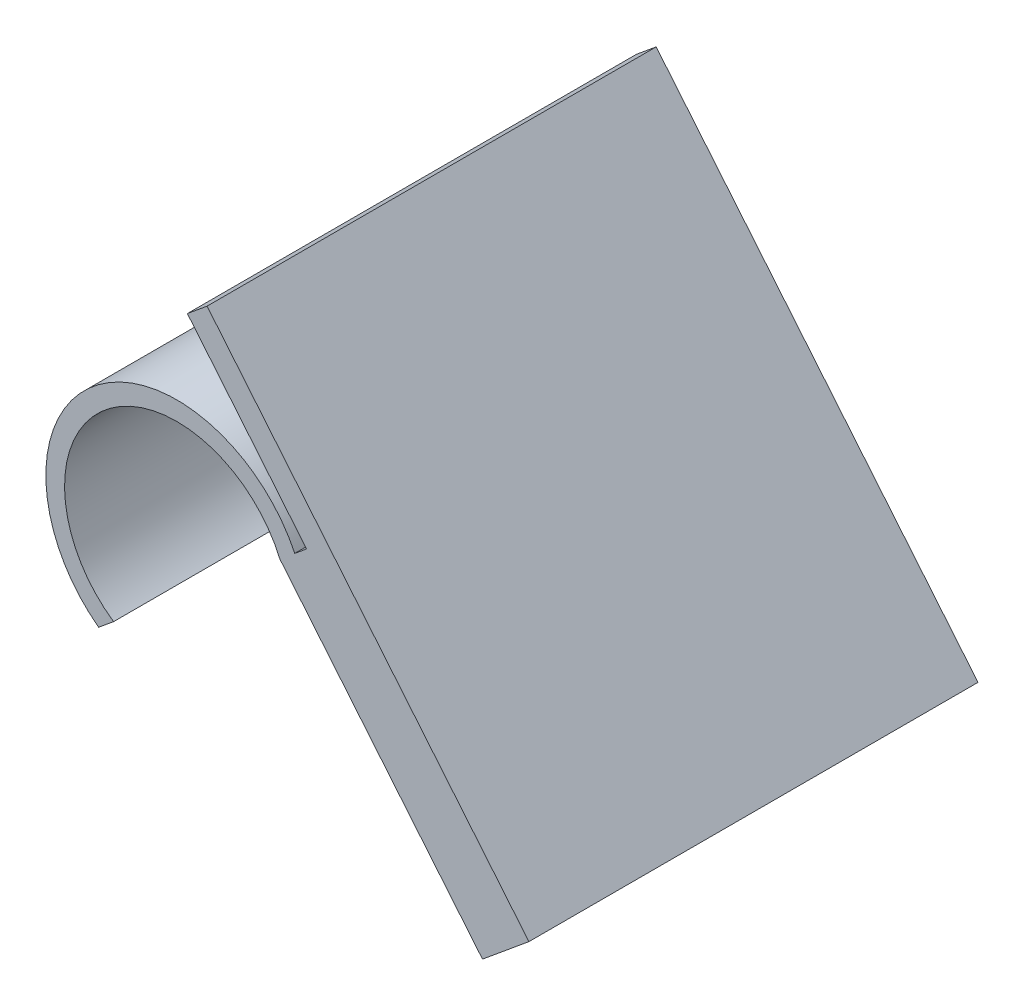
ISO-10303-21;
HEADER;
FILE_DESCRIPTION(('STEP AP214'),'2;1');
FILE_NAME('part.step','',(''),(''),'','','');
FILE_SCHEMA(('AUTOMOTIVE_DESIGN { 1 0 10303 214 1 1 1 1 }'));
ENDSEC;
DATA;
#1=APPLICATION_CONTEXT('core data for automotive mechanical design processes');
#2=APPLICATION_PROTOCOL_DEFINITION('international standard','automotive_design',2000,#1);
#3=PRODUCT_CONTEXT('',#1,'mechanical');
#4=PRODUCT('Part','Part','',(#3));
#5=PRODUCT_RELATED_PRODUCT_CATEGORY('part','',(#4));
#6=PRODUCT_DEFINITION_FORMATION('','',#4);
#7=PRODUCT_DEFINITION_CONTEXT('part definition',#1,'design');
#8=PRODUCT_DEFINITION('design','',#6,#7);
#9=PRODUCT_DEFINITION_SHAPE('','',#8);
#10=(LENGTH_UNIT() NAMED_UNIT(*) SI_UNIT(.MILLI.,.METRE.));
#11=(NAMED_UNIT(*) PLANE_ANGLE_UNIT() SI_UNIT($,.RADIAN.));
#12=(NAMED_UNIT(*) SI_UNIT($,.STERADIAN.) SOLID_ANGLE_UNIT());
#13=UNCERTAINTY_MEASURE_WITH_UNIT(LENGTH_MEASURE(1.E-05),#10,'distance_accuracy_value','');
#14=(GEOMETRIC_REPRESENTATION_CONTEXT(3) GLOBAL_UNCERTAINTY_ASSIGNED_CONTEXT((#13)) GLOBAL_UNIT_ASSIGNED_CONTEXT((#10,
#11,#12)) REPRESENTATION_CONTEXT('',''));
#15=CARTESIAN_POINT('',(0.,0.,0.));
#16=DIRECTION('',(0.,0.,1.));
#17=DIRECTION('',(1.,0.,0.));
#18=AXIS2_PLACEMENT_3D('',#15,#16,#17);
#19=CARTESIAN_POINT('',(6.74647177905313,-8.16423119668458,0.));
#20=DIRECTION('',(0.636999680329431,-0.770864065357961,0.));
#21=DIRECTION('',(0.770864065357961,0.636999680329431,0.));
#22=AXIS2_PLACEMENT_3D('',#19,#20,#21);
#23=PLANE('',#22);
#24=DIRECTION('',(0.,0.,1.));
#25=VECTOR('',#24,1.);
#26=CARTESIAN_POINT('',(44.0234550776681,22.6394182558772,0.));
#27=LINE('',#26,#25);
#28=CARTESIAN_POINT('',(44.0234550776681,22.6394182558772,0.));
#29=VERTEX_POINT('',#28);
#30=CARTESIAN_POINT('',(44.0234550776681,22.6394182558772,152.4));
#31=VERTEX_POINT('',#30);
#32=EDGE_CURVE('E132',#29,#31,#27,.T.);
#33=ORIENTED_EDGE('',*,*,#32,.F.);
#34=DIRECTION('',(0.770864065357961,0.636999680329431,0.));
#35=VECTOR('',#34,1.);
#36=CARTESIAN_POINT('',(34.9588375440872,15.1489167126274,0.));
#37=LINE('',#36,#35);
#38=CARTESIAN_POINT('',(40.0245310525491,19.3349273084627,0.));
#39=VERTEX_POINT('',#38);
#40=EDGE_CURVE('E149',#39,#29,#37,.T.);
#41=ORIENTED_EDGE('',*,*,#40,.F.);
#42=DIRECTION('',(0.,0.,1.));
#43=VECTOR('',#42,1.);
#44=CARTESIAN_POINT('',(40.0245310525491,19.3349273084627,0.));
#45=LINE('',#44,#43);
#46=CARTESIAN_POINT('',(40.0245310525491,19.3349273084627,152.4));
#47=VERTEX_POINT('',#46);
#48=EDGE_CURVE('E160',#39,#47,#45,.T.);
#49=ORIENTED_EDGE('',*,*,#48,.T.);
#50=DIRECTION('',(-0.770864065357961,-0.636999680329431,0.));
#51=VECTOR('',#50,1.);
#52=CARTESIAN_POINT('',(34.9588375440872,15.1489167126274,152.4));
#53=LINE('',#52,#51);
#54=EDGE_CURVE('E152',#31,#47,#53,.T.);
#55=ORIENTED_EDGE('',*,*,#54,.F.);
#56=EDGE_LOOP('',(#33,#41,#49,#55));
#57=FACE_BOUND('',#56,.T.);
#58=ADVANCED_FACE('F33',(#57),#23,.F.);
#59=CARTESIAN_POINT('',(0.,0.,152.4));
#60=DIRECTION('',(0.,0.,1.));
#61=DIRECTION('',(1.,0.,0.));
#62=AXIS2_PLACEMENT_3D('',#59,#60,#61);
#63=PLANE('',#62);
#64=CARTESIAN_POINT('',(0.,0.,152.4));
#65=DIRECTION('',(0.,0.,1.));
#66=DIRECTION('',(1.,0.,0.));
#67=AXIS2_PLACEMENT_3D('',#64,#65,#66);
#68=CIRCLE('',#67,38.1);
#69=CARTESIAN_POINT('',(34.9588375440872,15.1489167126274,152.4));
#70=VERTEX_POINT('',#69);
#71=CARTESIAN_POINT('',(-21.4658939859809,-31.4773791059966,152.4));
#72=VERTEX_POINT('',#71);
#73=EDGE_CURVE('E167',#70,#72,#68,.T.);
#74=ORIENTED_EDGE('',*,*,#73,.F.);
#75=DIRECTION('',(-0.636999680329431,0.770864065357961,0.));
#76=VECTOR('',#75,1.);
#77=CARTESIAN_POINT('',(39.0037855141791,10.2539298976043,152.4));
#78=LINE('',#77,#76);
#79=CARTESIAN_POINT('',(103.722953035649,-68.0658591427645,152.4));
#80=VERTEX_POINT('',#79);
#81=EDGE_CURVE('E154',#80,#70,#78,.T.);
#82=ORIENTED_EDGE('',*,*,#81,.F.);
#83=DIRECTION('',(-0.770864065357961,-0.636999680329431,0.));
#84=VECTOR('',#83,1.);
#85=CARTESIAN_POINT('',(103.722953035649,-68.0658591427645,152.4));
#86=LINE('',#85,#84);
#87=CARTESIAN_POINT('',(119.4759009476,-55.0484891094383,152.4));
#88=VERTEX_POINT('',#87);
#89=EDGE_CURVE('E127',#88,#80,#86,.T.);
#90=ORIENTED_EDGE('',*,*,#89,.F.);
#91=DIRECTION('',(-0.636999680329431,0.770864065357961,0.));
#92=VECTOR('',#91,1.);
#93=CARTESIAN_POINT('',(54.7567334261296,23.2712999309305,152.4));
#94=LINE('',#93,#92);
#95=CARTESIAN_POINT('',(10.2623057551189,77.1161548961841,152.4));
#96=VERTEX_POINT('',#95);
#97=EDGE_CURVE('E156',#88,#96,#94,.T.);
#98=ORIENTED_EDGE('',*,*,#97,.T.);
#99=DIRECTION('',(0.770864065357961,0.636999680329432,0.));
#100=VECTOR('',#99,1.);
#101=CARTESIAN_POINT('',(10.2623057551189,77.1161548961841,152.4));
#102=LINE('',#101,#100);
#103=CARTESIAN_POINT('',(3.57397537674922,71.5892864061077,152.4));
#104=VERTEX_POINT('',#103);
#105=EDGE_CURVE('E140',#104,#96,#102,.T.);
#106=ORIENTED_EDGE('',*,*,#105,.F.);
#107=DIRECTION('',(0.636999680329431,-0.770864065357961,0.));
#108=VECTOR('',#107,1.);
#109=CARTESIAN_POINT('',(3.57397537674922,71.5892864061077,152.4));
#110=LINE('',#109,#108);
#111=EDGE_CURVE('E143',#104,#31,#110,.T.);
#112=ORIENTED_EDGE('',*,*,#111,.T.);
#113=ORIENTED_EDGE('',*,*,#54,.T.);
#114=CARTESIAN_POINT('',(0.,0.,152.4));
#115=DIRECTION('',(0.,0.,1.));
#116=DIRECTION('',(1.,0.,0.));
#117=AXIS2_PLACEMENT_3D('',#114,#115,#116);
#118=CIRCLE('',#117,44.45);
#119=CARTESIAN_POINT('',(-26.5315874944428,-35.6633897018319,152.4));
#120=VERTEX_POINT('',#119);
#121=EDGE_CURVE('E172',#47,#120,#118,.T.);
#122=ORIENTED_EDGE('',*,*,#121,.T.);
#123=DIRECTION('',(-0.770864065357961,-0.636999680329431,0.));
#124=VECTOR('',#123,1.);
#125=CARTESIAN_POINT('',(-26.5315874944428,-35.6633897018319,152.4));
#126=LINE('',#125,#124);
#127=EDGE_CURVE('E111',#72,#120,#126,.T.);
#128=ORIENTED_EDGE('',*,*,#127,.F.);
#129=EDGE_LOOP('',(#74,#82,#90,#98,#106,#112,#113,#122,#128));
#130=FACE_BOUND('',#129,.T.);
#131=ADVANCED_FACE('F179',(#130),#63,.T.);
#132=CARTESIAN_POINT('',(0.,0.,0.));
#133=DIRECTION('',(0.,0.,1.));
#134=DIRECTION('',(1.,0.,0.));
#135=AXIS2_PLACEMENT_3D('',#132,#133,#134);
#136=PLANE('',#135);
#137=CARTESIAN_POINT('',(0.,0.,0.));
#138=DIRECTION('',(0.,0.,1.));
#139=DIRECTION('',(1.,0.,0.));
#140=AXIS2_PLACEMENT_3D('',#137,#138,#139);
#141=CIRCLE('',#140,44.45);
#142=CARTESIAN_POINT('',(-26.5315874944428,-35.6633897018319,0.));
#143=VERTEX_POINT('',#142);
#144=EDGE_CURVE('E170',#39,#143,#141,.T.);
#145=ORIENTED_EDGE('',*,*,#144,.F.);
#146=ORIENTED_EDGE('',*,*,#40,.T.);
#147=DIRECTION('',(0.636999680329431,-0.770864065357961,0.));
#148=VECTOR('',#147,1.);
#149=CARTESIAN_POINT('',(3.57397537674922,71.5892864061077,0.));
#150=LINE('',#149,#148);
#151=CARTESIAN_POINT('',(3.57397537674922,71.5892864061077,0.));
#152=VERTEX_POINT('',#151);
#153=EDGE_CURVE('E147',#152,#29,#150,.T.);
#154=ORIENTED_EDGE('',*,*,#153,.F.);
#155=DIRECTION('',(-0.770864065357961,-0.636999680329432,0.));
#156=VECTOR('',#155,1.);
#157=CARTESIAN_POINT('',(10.2623057551189,77.1161548961841,0.));
#158=LINE('',#157,#156);
#159=CARTESIAN_POINT('',(10.2623057551189,77.1161548961841,0.));
#160=VERTEX_POINT('',#159);
#161=EDGE_CURVE('E136',#160,#152,#158,.T.);
#162=ORIENTED_EDGE('',*,*,#161,.F.);
#163=DIRECTION('',(-0.636999680329431,0.770864065357961,0.));
#164=VECTOR('',#163,1.);
#165=CARTESIAN_POINT('',(54.7567334261296,23.2712999309305,0.));
#166=LINE('',#165,#164);
#167=CARTESIAN_POINT('',(119.4759009476,-55.0484891094383,0.));
#168=VERTEX_POINT('',#167);
#169=EDGE_CURVE('E112',#168,#160,#166,.T.);
#170=ORIENTED_EDGE('',*,*,#169,.F.);
#171=DIRECTION('',(0.770864065357961,0.636999680329431,0.));
#172=VECTOR('',#171,1.);
#173=CARTESIAN_POINT('',(103.722953035649,-68.0658591427645,0.));
#174=LINE('',#173,#172);
#175=CARTESIAN_POINT('',(103.722953035649,-68.0658591427645,0.));
#176=VERTEX_POINT('',#175);
#177=EDGE_CURVE('E115',#176,#168,#174,.T.);
#178=ORIENTED_EDGE('',*,*,#177,.F.);
#179=DIRECTION('',(-0.636999680329431,0.770864065357961,0.));
#180=VECTOR('',#179,1.);
#181=CARTESIAN_POINT('',(39.0037855141791,10.2539298976043,0.));
#182=LINE('',#181,#180);
#183=CARTESIAN_POINT('',(34.9588375440872,15.1489167126274,0.));
#184=VERTEX_POINT('',#183);
#185=EDGE_CURVE('E104',#176,#184,#182,.T.);
#186=ORIENTED_EDGE('',*,*,#185,.T.);
#187=CARTESIAN_POINT('',(0.,0.,0.));
#188=DIRECTION('',(0.,0.,1.));
#189=DIRECTION('',(1.,0.,0.));
#190=AXIS2_PLACEMENT_3D('',#187,#188,#189);
#191=CIRCLE('',#190,38.1);
#192=CARTESIAN_POINT('',(-21.4658939859809,-31.4773791059966,0.));
#193=VERTEX_POINT('',#192);
#194=EDGE_CURVE('E55',#184,#193,#191,.T.);
#195=ORIENTED_EDGE('',*,*,#194,.T.);
#196=DIRECTION('',(-0.770864065357961,-0.636999680329431,0.));
#197=VECTOR('',#196,1.);
#198=CARTESIAN_POINT('',(-26.5315874944428,-35.6633897018319,0.));
#199=LINE('',#198,#197);
#200=EDGE_CURVE('E48',#193,#143,#199,.T.);
#201=ORIENTED_EDGE('',*,*,#200,.T.);
#202=EDGE_LOOP('',(#145,#146,#154,#162,#170,#178,#186,#195,#201));
#203=FACE_BOUND('',#202,.T.);
#204=ADVANCED_FACE('F117',(#203),#136,.F.);
#205=CARTESIAN_POINT('',(0.,0.,152.4));
#206=DIRECTION('',(0.,0.,-1.));
#207=DIRECTION('',(-1.,0.,0.));
#208=AXIS2_PLACEMENT_3D('',#205,#206,#207);
#209=CYLINDRICAL_SURFACE('',#208,44.45);
#210=ORIENTED_EDGE('',*,*,#144,.T.);
#211=DIRECTION('',(0.,0.,1.));
#212=VECTOR('',#211,1.);
#213=CARTESIAN_POINT('',(-26.5315874944428,-35.6633897018319,0.));
#214=LINE('',#213,#212);
#215=EDGE_CURVE('E162',#143,#120,#214,.T.);
#216=ORIENTED_EDGE('',*,*,#215,.T.);
#217=ORIENTED_EDGE('',*,*,#121,.F.);
#218=ORIENTED_EDGE('',*,*,#48,.F.);
#219=EDGE_LOOP('',(#210,#216,#217,#218));
#220=FACE_BOUND('',#219,.T.);
#221=ADVANCED_FACE('F35',(#220),#209,.T.);
#222=CARTESIAN_POINT('',(0.,0.,152.4));
#223=DIRECTION('',(0.,0.,-1.));
#224=DIRECTION('',(-1.,0.,0.));
#225=AXIS2_PLACEMENT_3D('',#222,#223,#224);
#226=CYLINDRICAL_SURFACE('',#225,38.1);
#227=DIRECTION('',(0.,0.,-1.));
#228=VECTOR('',#227,1.);
#229=CARTESIAN_POINT('',(34.9588375440872,15.1489167126274,152.4));
#230=LINE('',#229,#228);
#231=EDGE_CURVE('E11',#70,#184,#230,.T.);
#232=ORIENTED_EDGE('',*,*,#231,.F.);
#233=ORIENTED_EDGE('',*,*,#73,.T.);
#234=DIRECTION('',(0.,0.,-1.));
#235=VECTOR('',#234,1.);
#236=CARTESIAN_POINT('',(-21.4658939859809,-31.4773791059966,152.4));
#237=LINE('',#236,#235);
#238=EDGE_CURVE('E41',#193,#72,#237,.F.);
#239=ORIENTED_EDGE('',*,*,#238,.F.);
#240=ORIENTED_EDGE('',*,*,#194,.F.);
#241=EDGE_LOOP('',(#232,#233,#239,#240));
#242=FACE_BOUND('',#241,.T.);
#243=ADVANCED_FACE('F181',(#242),#226,.F.);
#244=CARTESIAN_POINT('',(-26.5315874944428,-35.6633897018319,0.));
#245=DIRECTION('',(-0.636999680329431,0.770864065357961,0.));
#246=DIRECTION('',(-0.770864065357961,-0.636999680329431,0.));
#247=AXIS2_PLACEMENT_3D('',#244,#245,#246);
#248=PLANE('',#247);
#249=ORIENTED_EDGE('',*,*,#238,.T.);
#250=ORIENTED_EDGE('',*,*,#127,.T.);
#251=ORIENTED_EDGE('',*,*,#215,.F.);
#252=ORIENTED_EDGE('',*,*,#200,.F.);
#253=EDGE_LOOP('',(#249,#250,#251,#252));
#254=FACE_BOUND('',#253,.T.);
#255=ADVANCED_FACE('F177',(#254),#248,.F.);
#256=CARTESIAN_POINT('',(39.0037855141791,10.2539298976043,152.4));
#257=DIRECTION('',(0.770864065357961,0.636999680329431,0.));
#258=DIRECTION('',(-0.636999680329431,0.770864065357961,0.));
#259=AXIS2_PLACEMENT_3D('',#256,#257,#258);
#260=PLANE('',#259);
#261=ORIENTED_EDGE('',*,*,#231,.T.);
#262=ORIENTED_EDGE('',*,*,#185,.F.);
#263=DIRECTION('',(0.,0.,-1.));
#264=VECTOR('',#263,1.);
#265=CARTESIAN_POINT('',(103.722953035649,-68.0658591427645,152.4));
#266=LINE('',#265,#264);
#267=EDGE_CURVE('E109',#80,#176,#266,.T.);
#268=ORIENTED_EDGE('',*,*,#267,.F.);
#269=ORIENTED_EDGE('',*,*,#81,.T.);
#270=EDGE_LOOP('',(#261,#262,#268,#269));
#271=FACE_BOUND('',#270,.T.);
#272=ADVANCED_FACE('F106',(#271),#260,.F.);
#273=CARTESIAN_POINT('',(54.7567334261296,23.2712999309305,152.4));
#274=DIRECTION('',(-0.770864065357961,-0.636999680329431,0.));
#275=DIRECTION('',(0.636999680329431,-0.770864065357961,0.));
#276=AXIS2_PLACEMENT_3D('',#273,#274,#275);
#277=PLANE('',#276);
#278=ORIENTED_EDGE('',*,*,#169,.T.);
#279=DIRECTION('',(0.,0.,-1.));
#280=VECTOR('',#279,1.);
#281=CARTESIAN_POINT('',(10.2623057551189,77.1161548961841,0.));
#282=LINE('',#281,#280);
#283=EDGE_CURVE('E133',#96,#160,#282,.T.);
#284=ORIENTED_EDGE('',*,*,#283,.F.);
#285=ORIENTED_EDGE('',*,*,#97,.F.);
#286=DIRECTION('',(0.,0.,1.));
#287=VECTOR('',#286,1.);
#288=CARTESIAN_POINT('',(119.4759009476,-55.0484891094383,152.4));
#289=LINE('',#288,#287);
#290=EDGE_CURVE('E122',#168,#88,#289,.T.);
#291=ORIENTED_EDGE('',*,*,#290,.F.);
#292=EDGE_LOOP('',(#278,#284,#285,#291));
#293=FACE_BOUND('',#292,.T.);
#294=ADVANCED_FACE('F189',(#293),#277,.F.);
#295=CARTESIAN_POINT('',(3.57397537674922,71.5892864061077,0.));
#296=DIRECTION('',(0.770864065357961,0.636999680329431,0.));
#297=DIRECTION('',(-0.636999680329431,0.770864065357961,0.));
#298=AXIS2_PLACEMENT_3D('',#295,#296,#297);
#299=PLANE('',#298);
#300=ORIENTED_EDGE('',*,*,#32,.T.);
#301=ORIENTED_EDGE('',*,*,#111,.F.);
#302=DIRECTION('',(0.,0.,1.));
#303=VECTOR('',#302,1.);
#304=CARTESIAN_POINT('',(3.57397537674922,71.5892864061077,0.));
#305=LINE('',#304,#303);
#306=EDGE_CURVE('E138',#152,#104,#305,.T.);
#307=ORIENTED_EDGE('',*,*,#306,.F.);
#308=ORIENTED_EDGE('',*,*,#153,.T.);
#309=EDGE_LOOP('',(#300,#301,#307,#308));
#310=FACE_BOUND('',#309,.T.);
#311=ADVANCED_FACE('F194',(#310),#299,.F.);
#312=CARTESIAN_POINT('',(-33.7030079218657,40.7856369535459,0.));
#313=DIRECTION('',(0.636999680329432,-0.770864065357961,0.));
#314=DIRECTION('',(0.770864065357961,0.636999680329432,0.));
#315=AXIS2_PLACEMENT_3D('',#312,#313,#314);
#316=PLANE('',#315);
#317=ORIENTED_EDGE('',*,*,#283,.T.);
#318=ORIENTED_EDGE('',*,*,#161,.T.);
#319=ORIENTED_EDGE('',*,*,#306,.T.);
#320=ORIENTED_EDGE('',*,*,#105,.T.);
#321=EDGE_LOOP('',(#317,#318,#319,#320));
#322=FACE_BOUND('',#321,.T.);
#323=ADVANCED_FACE('F186',(#322),#316,.F.);
#324=CARTESIAN_POINT('',(75.5105872706152,-91.3790070520764,0.));
#325=DIRECTION('',(0.636999680329431,-0.770864065357961,0.));
#326=DIRECTION('',(0.770864065357961,0.636999680329431,0.));
#327=AXIS2_PLACEMENT_3D('',#324,#325,#326);
#328=PLANE('',#327);
#329=ORIENTED_EDGE('',*,*,#267,.T.);
#330=ORIENTED_EDGE('',*,*,#177,.T.);
#331=ORIENTED_EDGE('',*,*,#290,.T.);
#332=ORIENTED_EDGE('',*,*,#89,.T.);
#333=EDGE_LOOP('',(#329,#330,#331,#332));
#334=FACE_BOUND('',#333,.T.);
#335=ADVANCED_FACE('F125',(#334),#328,.T.);
#336=CLOSED_SHELL('',(#58,#131,#204,#221,#243,#255,#272,#294,#311,#323,#335));
#337=MANIFOLD_SOLID_BREP('B2',#336);
#338=ADVANCED_BREP_SHAPE_REPRESENTATION('',(#18,#337),#14);
#339=SHAPE_DEFINITION_REPRESENTATION(#9,#338);
ENDSEC;
END-ISO-10303-21;
